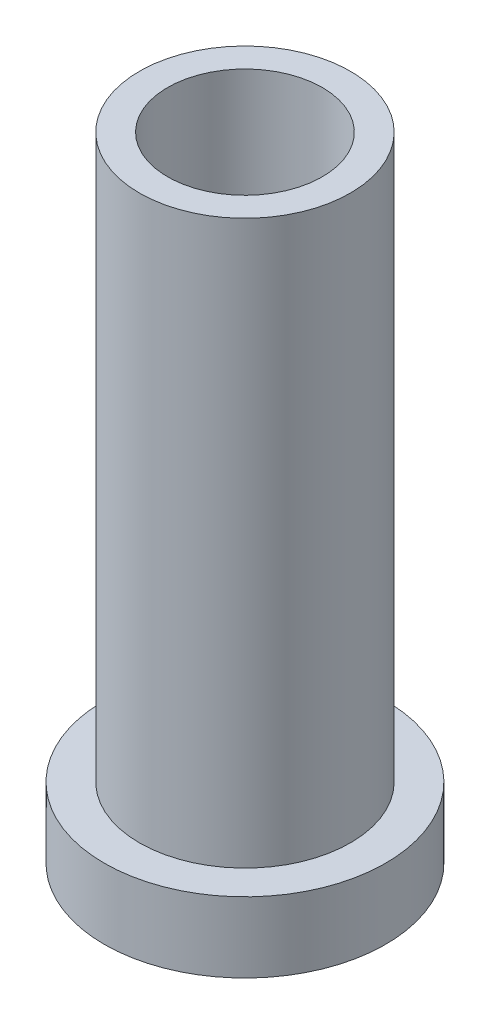
ISO-10303-21;
HEADER;
FILE_DESCRIPTION(('STEP AP214'),'2;1');
FILE_NAME('part.step','',(''),(''),'','','');
FILE_SCHEMA(('AUTOMOTIVE_DESIGN { 1 0 10303 214 1 1 1 1 }'));
ENDSEC;
DATA;
#1=APPLICATION_CONTEXT('core data for automotive mechanical design processes');
#2=APPLICATION_PROTOCOL_DEFINITION('international standard','automotive_design',2000,#1);
#3=PRODUCT_CONTEXT('',#1,'mechanical');
#4=PRODUCT('Part','Part','',(#3));
#5=PRODUCT_RELATED_PRODUCT_CATEGORY('part','',(#4));
#6=PRODUCT_DEFINITION_FORMATION('','',#4);
#7=PRODUCT_DEFINITION_CONTEXT('part definition',#1,'design');
#8=PRODUCT_DEFINITION('design','',#6,#7);
#9=PRODUCT_DEFINITION_SHAPE('','',#8);
#10=(LENGTH_UNIT() NAMED_UNIT(*) SI_UNIT(.MILLI.,.METRE.));
#11=(NAMED_UNIT(*) PLANE_ANGLE_UNIT() SI_UNIT($,.RADIAN.));
#12=(NAMED_UNIT(*) SI_UNIT($,.STERADIAN.) SOLID_ANGLE_UNIT());
#13=UNCERTAINTY_MEASURE_WITH_UNIT(LENGTH_MEASURE(1.E-05),#10,'distance_accuracy_value','');
#14=(GEOMETRIC_REPRESENTATION_CONTEXT(3) GLOBAL_UNCERTAINTY_ASSIGNED_CONTEXT((#13)) GLOBAL_UNIT_ASSIGNED_CONTEXT((#10,
#11,#12)) REPRESENTATION_CONTEXT('',''));
#15=CARTESIAN_POINT('',(0.,0.,0.));
#16=DIRECTION('',(0.,0.,1.));
#17=DIRECTION('',(1.,0.,0.));
#18=AXIS2_PLACEMENT_3D('',#15,#16,#17);
#19=CARTESIAN_POINT('',(0.,2.5,0.));
#20=DIRECTION('',(0.,-1.,0.));
#21=DIRECTION('',(0.,0.,-1.));
#22=AXIS2_PLACEMENT_3D('',#19,#20,#21);
#23=CYLINDRICAL_SURFACE('',#22,10.);
#24=CARTESIAN_POINT('',(0.,2.5,0.));
#25=DIRECTION('',(0.,1.,0.));
#26=DIRECTION('',(0.,0.,1.));
#27=AXIS2_PLACEMENT_3D('',#24,#25,#26);
#28=CIRCLE('',#27,10.);
#29=CARTESIAN_POINT('',(0.,2.5,10.));
#30=VERTEX_POINT('',#29);
#31=EDGE_CURVE('E10',#30,#30,#28,.T.);
#32=ORIENTED_EDGE('',*,*,#31,.F.);
#33=EDGE_LOOP('',(#32));
#34=FACE_BOUND('',#33,.T.);
#35=CARTESIAN_POINT('',(0.,-2.5,0.));
#36=DIRECTION('',(0.,1.,0.));
#37=DIRECTION('',(0.,0.,1.));
#38=AXIS2_PLACEMENT_3D('',#35,#36,#37);
#39=CIRCLE('',#38,10.);
#40=CARTESIAN_POINT('',(0.,-2.5,10.));
#41=VERTEX_POINT('',#40);
#42=EDGE_CURVE('E34',#41,#41,#39,.T.);
#43=ORIENTED_EDGE('',*,*,#42,.T.);
#44=EDGE_LOOP('',(#43));
#45=FACE_BOUND('',#44,.T.);
#46=ADVANCED_FACE('F31',(#34,#45),#23,.T.);
#47=CARTESIAN_POINT('',(0.,2.5,0.));
#48=DIRECTION('',(0.,1.,0.));
#49=DIRECTION('',(0.,0.,1.));
#50=AXIS2_PLACEMENT_3D('',#47,#48,#49);
#51=PLANE('',#50);
#52=CARTESIAN_POINT('',(0.,2.5,0.));
#53=DIRECTION('',(0.,1.,0.));
#54=DIRECTION('',(0.,0.,1.));
#55=AXIS2_PLACEMENT_3D('',#52,#53,#54);
#56=CIRCLE('',#55,7.5);
#57=CARTESIAN_POINT('',(0.,2.5,7.5));
#58=VERTEX_POINT('',#57);
#59=EDGE_CURVE('E43',#58,#58,#56,.T.);
#60=ORIENTED_EDGE('',*,*,#59,.F.);
#61=EDGE_LOOP('',(#60));
#62=FACE_BOUND('',#61,.T.);
#63=ORIENTED_EDGE('',*,*,#31,.T.);
#64=EDGE_LOOP('',(#63));
#65=FACE_BOUND('',#64,.T.);
#66=ADVANCED_FACE('F68',(#62,#65),#51,.T.);
#67=CARTESIAN_POINT('',(0.,-2.5,0.));
#68=DIRECTION('',(0.,1.,0.));
#69=DIRECTION('',(0.,0.,1.));
#70=AXIS2_PLACEMENT_3D('',#67,#68,#69);
#71=PLANE('',#70);
#72=CARTESIAN_POINT('',(0.,-2.5,0.));
#73=DIRECTION('',(0.,-1.,0.));
#74=DIRECTION('',(0.,0.,-1.));
#75=AXIS2_PLACEMENT_3D('',#72,#73,#74);
#76=CIRCLE('',#75,5.5);
#77=CARTESIAN_POINT('',(0.,-2.5,-5.5));
#78=VERTEX_POINT('',#77);
#79=EDGE_CURVE('E49',#78,#78,#76,.T.);
#80=ORIENTED_EDGE('',*,*,#79,.F.);
#81=EDGE_LOOP('',(#80));
#82=FACE_BOUND('',#81,.T.);
#83=ORIENTED_EDGE('',*,*,#42,.F.);
#84=EDGE_LOOP('',(#83));
#85=FACE_BOUND('',#84,.T.);
#86=ADVANCED_FACE('F64',(#82,#85),#71,.F.);
#87=CARTESIAN_POINT('',(0.,42.5,0.));
#88=DIRECTION('',(0.,-1.,0.));
#89=DIRECTION('',(0.,0.,-1.));
#90=AXIS2_PLACEMENT_3D('',#87,#88,#89);
#91=CYLINDRICAL_SURFACE('',#90,7.5);
#92=CARTESIAN_POINT('',(0.,42.5,0.));
#93=DIRECTION('',(0.,1.,0.));
#94=DIRECTION('',(0.,0.,1.));
#95=AXIS2_PLACEMENT_3D('',#92,#93,#94);
#96=CIRCLE('',#95,7.5);
#97=CARTESIAN_POINT('',(0.,42.5,7.5));
#98=VERTEX_POINT('',#97);
#99=EDGE_CURVE('E41',#98,#98,#96,.T.);
#100=ORIENTED_EDGE('',*,*,#99,.F.);
#101=EDGE_LOOP('',(#100));
#102=FACE_BOUND('',#101,.T.);
#103=ORIENTED_EDGE('',*,*,#59,.T.);
#104=EDGE_LOOP('',(#103));
#105=FACE_BOUND('',#104,.T.);
#106=ADVANCED_FACE('F67',(#102,#105),#91,.T.);
#107=CARTESIAN_POINT('',(0.,42.5,0.));
#108=DIRECTION('',(0.,1.,0.));
#109=DIRECTION('',(0.,0.,1.));
#110=AXIS2_PLACEMENT_3D('',#107,#108,#109);
#111=PLANE('',#110);
#112=CARTESIAN_POINT('',(0.,42.5,0.));
#113=DIRECTION('',(0.,-1.,0.));
#114=DIRECTION('',(0.,0.,-1.));
#115=AXIS2_PLACEMENT_3D('',#112,#113,#114);
#116=CIRCLE('',#115,5.5);
#117=CARTESIAN_POINT('',(0.,42.5,-5.5));
#118=VERTEX_POINT('',#117);
#119=EDGE_CURVE('E46',#118,#118,#116,.T.);
#120=ORIENTED_EDGE('',*,*,#119,.T.);
#121=EDGE_LOOP('',(#120));
#122=FACE_BOUND('',#121,.T.);
#123=ORIENTED_EDGE('',*,*,#99,.T.);
#124=EDGE_LOOP('',(#123));
#125=FACE_BOUND('',#124,.T.);
#126=ADVANCED_FACE('F55',(#122,#125),#111,.T.);
#127=CARTESIAN_POINT('',(0.,42.5,0.));
#128=DIRECTION('',(0.,-1.,0.));
#129=DIRECTION('',(0.,0.,-1.));
#130=AXIS2_PLACEMENT_3D('',#127,#128,#129);
#131=CYLINDRICAL_SURFACE('',#130,5.5);
#132=ORIENTED_EDGE('',*,*,#119,.F.);
#133=EDGE_LOOP('',(#132));
#134=FACE_BOUND('',#133,.T.);
#135=ORIENTED_EDGE('',*,*,#79,.T.);
#136=EDGE_LOOP('',(#135));
#137=FACE_BOUND('',#136,.T.);
#138=ADVANCED_FACE('F58',(#134,#137),#131,.F.);
#139=CLOSED_SHELL('',(#46,#66,#86,#106,#126,#138));
#140=MANIFOLD_SOLID_BREP('B2',#139);
#141=ADVANCED_BREP_SHAPE_REPRESENTATION('',(#18,#140),#14);
#142=SHAPE_DEFINITION_REPRESENTATION(#9,#141);
ENDSEC;
END-ISO-10303-21;
